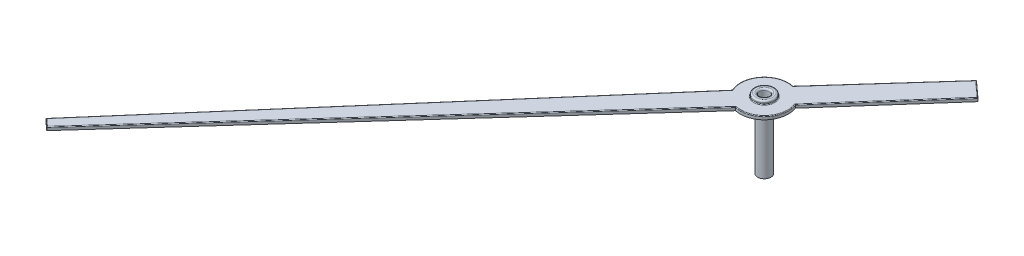
ISO-10303-21;
HEADER;
FILE_DESCRIPTION(('STEP AP214'),'2;1');
FILE_NAME('part.step','',(''),(''),'','','');
FILE_SCHEMA(('AUTOMOTIVE_DESIGN { 1 0 10303 214 1 1 1 1 }'));
ENDSEC;
DATA;
#1=APPLICATION_CONTEXT('core data for automotive mechanical design processes');
#2=APPLICATION_PROTOCOL_DEFINITION('international standard','automotive_design',2000,#1);
#3=PRODUCT_CONTEXT('',#1,'mechanical');
#4=PRODUCT('Part','Part','',(#3));
#5=PRODUCT_RELATED_PRODUCT_CATEGORY('part','',(#4));
#6=PRODUCT_DEFINITION_FORMATION('','',#4);
#7=PRODUCT_DEFINITION_CONTEXT('part definition',#1,'design');
#8=PRODUCT_DEFINITION('design','',#6,#7);
#9=PRODUCT_DEFINITION_SHAPE('','',#8);
#10=(LENGTH_UNIT() NAMED_UNIT(*) SI_UNIT(.MILLI.,.METRE.));
#11=(NAMED_UNIT(*) PLANE_ANGLE_UNIT() SI_UNIT($,.RADIAN.));
#12=(NAMED_UNIT(*) SI_UNIT($,.STERADIAN.) SOLID_ANGLE_UNIT());
#13=UNCERTAINTY_MEASURE_WITH_UNIT(LENGTH_MEASURE(1.E-05),#10,'distance_accuracy_value','');
#14=(GEOMETRIC_REPRESENTATION_CONTEXT(3) GLOBAL_UNCERTAINTY_ASSIGNED_CONTEXT((#13)) GLOBAL_UNIT_ASSIGNED_CONTEXT((#10,
#11,#12)) REPRESENTATION_CONTEXT('',''));
#15=CARTESIAN_POINT('',(0.,0.,0.));
#16=DIRECTION('',(0.,0.,1.));
#17=DIRECTION('',(1.,0.,0.));
#18=AXIS2_PLACEMENT_3D('',#15,#16,#17);
#19=CARTESIAN_POINT('',(-72.4331347315,-1.9,38.1727367454838));
#20=DIRECTION('',(0.,1.,0.));
#21=DIRECTION('',(0.,0.,1.));
#22=AXIS2_PLACEMENT_3D('',#19,#20,#21);
#23=PLANE('',#22);
#24=CARTESIAN_POINT('',(-72.4331347315,-1.9,38.1727367454838));
#25=DIRECTION('',(0.,1.,0.));
#26=DIRECTION('',(0.,0.,1.));
#27=AXIS2_PLACEMENT_3D('',#24,#25,#26);
#28=CIRCLE('',#27,0.149999999999991);
#29=CARTESIAN_POINT('',(-72.4331347315,-1.9,38.3227367454838));
#30=VERTEX_POINT('',#29);
#31=EDGE_CURVE('E158',#30,#30,#28,.T.);
#32=ORIENTED_EDGE('',*,*,#31,.T.);
#33=EDGE_LOOP('',(#32));
#34=FACE_BOUND('',#33,.T.);
#35=CARTESIAN_POINT('',(-72.4331347315,-1.9,38.1727367454838));
#36=DIRECTION('',(0.,-1.,0.));
#37=DIRECTION('',(0.,0.,-1.));
#38=AXIS2_PLACEMENT_3D('',#35,#36,#37);
#39=CIRCLE('',#38,0.200000000000002);
#40=CARTESIAN_POINT('',(-72.4331347315,-1.9,37.9727367454838));
#41=VERTEX_POINT('',#40);
#42=EDGE_CURVE('E579',#41,#41,#39,.T.);
#43=ORIENTED_EDGE('',*,*,#42,.T.);
#44=EDGE_LOOP('',(#43));
#45=FACE_BOUND('',#44,.T.);
#46=ADVANCED_FACE('F43',(#34,#45),#23,.F.);
#47=CARTESIAN_POINT('',(-20.5910862957085,0.1,-18.6227753418155));
#48=DIRECTION('',(-0.741665773740884,0.,-0.670769617723802));
#49=DIRECTION('',(-0.670769617723802,0.,0.741665773740884));
#50=AXIS2_PLACEMENT_3D('',#47,#48,#49);
#51=PLANE('',#50);
#52=DIRECTION('',(0.,-1.,0.));
#53=VECTOR('',#52,1.);
#54=CARTESIAN_POINT('',(-72.5929628220083,0.1,38.8753745009477));
#55=LINE('',#54,#53);
#56=CARTESIAN_POINT('',(-72.5929628220083,0.08,38.8753745009477));
#57=VERTEX_POINT('',#56);
#58=CARTESIAN_POINT('',(-72.5929628220083,0.,38.8753745009477));
#59=VERTEX_POINT('',#58);
#60=EDGE_CURVE('E133',#57,#59,#55,.T.);
#61=ORIENTED_EDGE('',*,*,#60,.F.);
#62=DIRECTION('',(0.670769617723802,0.,-0.741665773740884));
#63=VECTOR('',#62,1.);
#64=CARTESIAN_POINT('',(-82.4062532848466,0.08,49.7258684287479));
#65=LINE('',#64,#63);
#66=CARTESIAN_POINT('',(-82.4062532848466,0.08,49.7258684287479));
#67=VERTEX_POINT('',#66);
#68=EDGE_CURVE('E52',#57,#67,#65,.F.);
#69=ORIENTED_EDGE('',*,*,#68,.T.);
#70=DIRECTION('',(0.,-1.,0.));
#71=VECTOR('',#70,1.);
#72=CARTESIAN_POINT('',(-82.4062532848466,0.1,49.7258684287479));
#73=LINE('',#72,#71);
#74=CARTESIAN_POINT('',(-82.4062532848466,0.,49.7258684287479));
#75=VERTEX_POINT('',#74);
#76=EDGE_CURVE('E156',#67,#75,#73,.T.);
#77=ORIENTED_EDGE('',*,*,#76,.T.);
#78=DIRECTION('',(0.670769617723802,0.,-0.741665773740885));
#79=VECTOR('',#78,1.);
#80=CARTESIAN_POINT('',(-20.5910862957085,0.,-18.6227753418155));
#81=LINE('',#80,#79);
#82=EDGE_CURVE('E149',#75,#59,#81,.T.);
#83=ORIENTED_EDGE('',*,*,#82,.T.);
#84=EDGE_LOOP('',(#61,#69,#77,#83));
#85=FACE_BOUND('',#84,.T.);
#86=ADVANCED_FACE('F154',(#85),#51,.F.);
#87=CARTESIAN_POINT('',(-72.4331347315,0.1,38.1727367454838));
#88=DIRECTION('',(0.,-1.,0.));
#89=DIRECTION('',(0.,0.,-1.));
#90=AXIS2_PLACEMENT_3D('',#87,#88,#89);
#91=CYLINDRICAL_SURFACE('',#90,0.720586451384451);
#92=DIRECTION('',(0.,-1.,0.));
#93=VECTOR('',#92,1.);
#94=CARTESIAN_POINT('',(-71.7602884856588,0.1,37.9148166738022));
#95=LINE('',#94,#93);
#96=CARTESIAN_POINT('',(-71.7602884856588,0.08,37.9148166738022));
#97=VERTEX_POINT('',#96);
#98=CARTESIAN_POINT('',(-71.7602884856588,0.,37.9148166738022));
#99=VERTEX_POINT('',#98);
#100=EDGE_CURVE('E142',#97,#99,#95,.T.);
#101=ORIENTED_EDGE('',*,*,#100,.F.);
#102=CARTESIAN_POINT('',(-72.4331347315,0.08,38.1727367454838));
#103=DIRECTION('',(0.,1.,0.));
#104=DIRECTION('',(0.,0.,1.));
#105=AXIS2_PLACEMENT_3D('',#102,#103,#104);
#106=CIRCLE('',#105,0.720586451384451);
#107=EDGE_CURVE('E60',#97,#57,#106,.F.);
#108=ORIENTED_EDGE('',*,*,#107,.T.);
#109=ORIENTED_EDGE('',*,*,#60,.T.);
#110=CARTESIAN_POINT('',(-72.4331347315,0.,38.1727367454838));
#111=DIRECTION('',(0.,1.,0.));
#112=DIRECTION('',(0.,0.,1.));
#113=AXIS2_PLACEMENT_3D('',#110,#111,#112);
#114=CIRCLE('',#113,0.720586451384451);
#115=EDGE_CURVE('E136',#59,#99,#114,.T.);
#116=ORIENTED_EDGE('',*,*,#115,.T.);
#117=EDGE_LOOP('',(#101,#108,#109,#116));
#118=FACE_BOUND('',#117,.T.);
#119=ADVANCED_FACE('F135',(#118),#91,.T.);
#120=CARTESIAN_POINT('',(-21.5246084224785,0.1,-18.9989702186049));
#121=DIRECTION('',(0.749722609737751,0.,0.66175222587311));
#122=DIRECTION('',(0.66175222587311,0.,-0.749722609737751));
#123=AXIS2_PLACEMENT_3D('',#120,#121,#122);
#124=PLANE('',#123);
#125=DIRECTION('',(0.,-1.,0.));
#126=VECTOR('',#125,1.);
#127=CARTESIAN_POINT('',(-69.1910545265949,0.1,35.0040402328544));
#128=LINE('',#127,#126);
#129=CARTESIAN_POINT('',(-69.1910545265949,0.08,35.0040402328544));
#130=VERTEX_POINT('',#129);
#131=CARTESIAN_POINT('',(-69.1910545265949,0.,35.0040402328544));
#132=VERTEX_POINT('',#131);
#133=EDGE_CURVE('E189',#130,#132,#128,.T.);
#134=ORIENTED_EDGE('',*,*,#133,.F.);
#135=DIRECTION('',(-0.66175222587311,0.,0.749722609737751));
#136=VECTOR('',#135,1.);
#137=CARTESIAN_POINT('',(-21.5246084224785,0.08,-18.9989702186049));
#138=LINE('',#137,#136);
#139=EDGE_CURVE('E68',#130,#97,#138,.T.);
#140=ORIENTED_EDGE('',*,*,#139,.T.);
#141=ORIENTED_EDGE('',*,*,#100,.T.);
#142=DIRECTION('',(-0.66175222587311,0.,0.749722609737751));
#143=VECTOR('',#142,1.);
#144=CARTESIAN_POINT('',(-21.5246084224785,0.,-18.9989702186049));
#145=LINE('',#144,#143);
#146=EDGE_CURVE('E152',#132,#99,#145,.T.);
#147=ORIENTED_EDGE('',*,*,#146,.F.);
#148=EDGE_LOOP('',(#134,#140,#141,#147));
#149=FACE_BOUND('',#148,.T.);
#150=ADVANCED_FACE('F348',(#149),#124,.T.);
#151=CARTESIAN_POINT('',(-48.5634749404629,0.1,53.6692380419098));
#152=DIRECTION('',(0.670955812760769,0.,-0.74149733466988));
#153=DIRECTION('',(-0.74149733466988,0.,-0.670955812760769));
#154=AXIS2_PLACEMENT_3D('',#151,#152,#153);
#155=PLANE('',#154);
#156=DIRECTION('',(0.,-1.,0.));
#157=VECTOR('',#156,1.);
#158=CARTESIAN_POINT('',(-69.6713257880086,0.1,34.5694590422275));
#159=LINE('',#158,#157);
#160=CARTESIAN_POINT('',(-69.6713257880086,0.08,34.5694590422275));
#161=VERTEX_POINT('',#160);
#162=CARTESIAN_POINT('',(-69.6713257880086,0.,34.5694590422275));
#163=VERTEX_POINT('',#162);
#164=EDGE_CURVE('E187',#161,#163,#159,.T.);
#165=ORIENTED_EDGE('',*,*,#164,.F.);
#166=DIRECTION('',(0.74149733466988,0.,0.670955812760769));
#167=VECTOR('',#166,1.);
#168=CARTESIAN_POINT('',(-48.5634749404629,0.08,53.6692380419098));
#169=LINE('',#168,#167);
#170=EDGE_CURVE('E233',#161,#130,#169,.T.);
#171=ORIENTED_EDGE('',*,*,#170,.T.);
#172=ORIENTED_EDGE('',*,*,#133,.T.);
#173=DIRECTION('',(0.74149733466988,0.,0.670955812760769));
#174=VECTOR('',#173,1.);
#175=CARTESIAN_POINT('',(-48.5634749404629,0.,53.6692380419098));
#176=LINE('',#175,#174);
#177=EDGE_CURVE('E167',#163,#132,#176,.T.);
#178=ORIENTED_EDGE('',*,*,#177,.F.);
#179=EDGE_LOOP('',(#165,#171,#172,#178));
#180=FACE_BOUND('',#179,.T.);
#181=ADVANCED_FACE('F344',(#180),#155,.T.);
#182=CARTESIAN_POINT('',(-21.3887116348689,0.1,-19.2045125334591));
#183=DIRECTION('',(-0.744077721453353,0.,-0.66809306570027));
#184=DIRECTION('',(-0.66809306570027,0.,0.744077721453353));
#185=AXIS2_PLACEMENT_3D('',#182,#183,#184);
#186=PLANE('',#185);
#187=DIRECTION('',(0.,-1.,0.));
#188=VECTOR('',#187,1.);
#189=CARTESIAN_POINT('',(-72.2753417109591,0.1,37.4696391728899));
#190=LINE('',#189,#188);
#191=CARTESIAN_POINT('',(-72.2753417109591,0.08,37.4696391728899));
#192=VERTEX_POINT('',#191);
#193=CARTESIAN_POINT('',(-72.2753417109591,0.,37.4696391728899));
#194=VERTEX_POINT('',#193);
#195=EDGE_CURVE('E185',#192,#194,#190,.T.);
#196=ORIENTED_EDGE('',*,*,#195,.F.);
#197=DIRECTION('',(0.66809306570027,0.,-0.744077721453353));
#198=VECTOR('',#197,1.);
#199=CARTESIAN_POINT('',(-21.3887116348689,0.08,-19.2045125334591));
#200=LINE('',#199,#198);
#201=EDGE_CURVE('E231',#192,#161,#200,.T.);
#202=ORIENTED_EDGE('',*,*,#201,.T.);
#203=ORIENTED_EDGE('',*,*,#164,.T.);
#204=DIRECTION('',(0.66809306570027,0.,-0.744077721453353));
#205=VECTOR('',#204,1.);
#206=CARTESIAN_POINT('',(-21.3887116348689,0.,-19.2045125334591));
#207=LINE('',#206,#205);
#208=EDGE_CURVE('E169',#194,#163,#207,.T.);
#209=ORIENTED_EDGE('',*,*,#208,.F.);
#210=EDGE_LOOP('',(#196,#202,#203,#209));
#211=FACE_BOUND('',#210,.T.);
#212=ADVANCED_FACE('F340',(#211),#186,.T.);
#213=CARTESIAN_POINT('',(-72.4331347315,0.1,38.1727367454838));
#214=DIRECTION('',(0.,-1.,0.));
#215=DIRECTION('',(0.,0.,-1.));
#216=AXIS2_PLACEMENT_3D('',#213,#214,#215);
#217=CYLINDRICAL_SURFACE('',#216,0.720586451384451);
#218=DIRECTION('',(0.,-1.,0.));
#219=VECTOR('',#218,1.);
#220=CARTESIAN_POINT('',(-73.0841907332714,0.1,38.4815585654322));
#221=LINE('',#220,#219);
#222=CARTESIAN_POINT('',(-73.0841907332714,0.08,38.4815585654322));
#223=VERTEX_POINT('',#222);
#224=CARTESIAN_POINT('',(-73.0841907332714,0.,38.4815585654322));
#225=VERTEX_POINT('',#224);
#226=EDGE_CURVE('E183',#223,#225,#221,.T.);
#227=ORIENTED_EDGE('',*,*,#226,.F.);
#228=CARTESIAN_POINT('',(-72.4331347315,0.08,38.1727367454838));
#229=DIRECTION('',(0.,1.,0.));
#230=DIRECTION('',(0.,0.,1.));
#231=AXIS2_PLACEMENT_3D('',#228,#229,#230);
#232=CIRCLE('',#231,0.720586451384451);
#233=EDGE_CURVE('E229',#223,#192,#232,.F.);
#234=ORIENTED_EDGE('',*,*,#233,.T.);
#235=ORIENTED_EDGE('',*,*,#195,.T.);
#236=CARTESIAN_POINT('',(-72.4331347315,0.,38.1727367454838));
#237=DIRECTION('',(0.,1.,0.));
#238=DIRECTION('',(0.,0.,1.));
#239=AXIS2_PLACEMENT_3D('',#236,#237,#238);
#240=CIRCLE('',#239,0.720586451384451);
#241=EDGE_CURVE('E172',#194,#225,#240,.T.);
#242=ORIENTED_EDGE('',*,*,#241,.T.);
#243=EDGE_LOOP('',(#227,#234,#235,#242));
#244=FACE_BOUND('',#243,.T.);
#245=ADVANCED_FACE('F336',(#244),#217,.T.);
#246=CARTESIAN_POINT('',(-22.6870649744685,0.1,-19.6638535265345));
#247=DIRECTION('',(-0.755660554117765,0.,-0.65496345466784));
#248=DIRECTION('',(-0.65496345466784,0.,0.755660554117765));
#249=AXIS2_PLACEMENT_3D('',#246,#247,#248);
#250=PLANE('',#249);
#251=DIRECTION('',(0.,-1.,0.));
#252=VECTOR('',#251,1.);
#253=CARTESIAN_POINT('',(-82.6438596158767,0.1,49.5109749909264));
#254=LINE('',#253,#252);
#255=CARTESIAN_POINT('',(-82.6438596158767,0.08,49.5109749909264));
#256=VERTEX_POINT('',#255);
#257=CARTESIAN_POINT('',(-82.6438596158767,0.,49.5109749909264));
#258=VERTEX_POINT('',#257);
#259=EDGE_CURVE('E181',#256,#258,#254,.T.);
#260=ORIENTED_EDGE('',*,*,#259,.F.);
#261=DIRECTION('',(0.65496345466784,0.,-0.755660554117765));
#262=VECTOR('',#261,1.);
#263=CARTESIAN_POINT('',(-22.6870649744685,0.08,-19.6638535265345));
#264=LINE('',#263,#262);
#265=EDGE_CURVE('E227',#256,#223,#264,.T.);
#266=ORIENTED_EDGE('',*,*,#265,.T.);
#267=ORIENTED_EDGE('',*,*,#226,.T.);
#268=DIRECTION('',(0.65496345466784,0.,-0.755660554117765));
#269=VECTOR('',#268,1.);
#270=CARTESIAN_POINT('',(-22.6870649744685,0.,-19.6638535265345));
#271=LINE('',#270,#269);
#272=EDGE_CURVE('E175',#258,#225,#271,.T.);
#273=ORIENTED_EDGE('',*,*,#272,.F.);
#274=EDGE_LOOP('',(#260,#266,#267,#273));
#275=FACE_BOUND('',#274,.T.);
#276=ADVANCED_FACE('F332',(#275),#250,.T.);
#277=CARTESIAN_POINT('',(-61.815166989138,0.1,68.3486437705634));
#278=DIRECTION('',(0.670769617723801,0.,-0.741665773740885));
#279=DIRECTION('',(-0.741665773740885,0.,-0.670769617723801));
#280=AXIS2_PLACEMENT_3D('',#277,#278,#279);
#281=PLANE('',#280);
#282=ORIENTED_EDGE('',*,*,#76,.F.);
#283=DIRECTION('',(0.741665773740885,0.,0.670769617723801));
#284=VECTOR('',#283,1.);
#285=CARTESIAN_POINT('',(-82.6438596158767,0.08,49.5109749909264));
#286=LINE('',#285,#284);
#287=EDGE_CURVE('E224',#67,#256,#286,.F.);
#288=ORIENTED_EDGE('',*,*,#287,.T.);
#289=ORIENTED_EDGE('',*,*,#259,.T.);
#290=DIRECTION('',(0.741665773740885,0.,0.670769617723801));
#291=VECTOR('',#290,1.);
#292=CARTESIAN_POINT('',(-61.815166989138,0.,68.3486437705634));
#293=LINE('',#292,#291);
#294=EDGE_CURVE('E178',#258,#75,#293,.T.);
#295=ORIENTED_EDGE('',*,*,#294,.T.);
#296=EDGE_LOOP('',(#282,#288,#289,#295));
#297=FACE_BOUND('',#296,.T.);
#298=ADVANCED_FACE('F326',(#297),#281,.F.);
#299=CARTESIAN_POINT('',(0.,0.1,0.));
#300=DIRECTION('',(0.,1.,0.));
#301=DIRECTION('',(0.,0.,1.));
#302=AXIS2_PLACEMENT_3D('',#299,#300,#301);
#303=PLANE('',#302);
#304=DIRECTION('',(0.65496345466784,0.,-0.755660554117765));
#305=VECTOR('',#304,1.);
#306=CARTESIAN_POINT('',(-22.6719517633861,0.1,-19.6507542574411));
#307=LINE('',#306,#305);
#308=CARTESIAN_POINT('',(-73.060436547422,0.1,38.4846883564821));
#309=VERTEX_POINT('',#308);
#310=CARTESIAN_POINT('',(-82.6159208053029,0.1,49.5092767937649));
#311=VERTEX_POINT('',#310);
#312=EDGE_CURVE('E219',#309,#311,#307,.F.);
#313=ORIENTED_EDGE('',*,*,#312,.T.);
#314=DIRECTION('',(0.741665773740885,0.,0.670769617723801));
#315=VECTOR('',#314,1.);
#316=CARTESIAN_POINT('',(-82.3928378924922,0.1,49.7110351132731));
#317=LINE('',#316,#315);
#318=CARTESIAN_POINT('',(-82.407671207967,0.1,49.6976197209187));
#319=VERTEX_POINT('',#318);
#320=EDGE_CURVE('E221',#311,#319,#317,.T.);
#321=ORIENTED_EDGE('',*,*,#320,.T.);
#322=DIRECTION('',(0.670769617723802,0.,-0.741665773740884));
#323=VECTOR('',#322,1.);
#324=CARTESIAN_POINT('',(-72.6077961374832,0.1,38.8619591085932));
#325=LINE('',#324,#323);
#326=CARTESIAN_POINT('',(-72.599868356992,0.1,38.853193411256));
#327=VERTEX_POINT('',#326);
#328=EDGE_CURVE('E206',#319,#327,#325,.T.);
#329=ORIENTED_EDGE('',*,*,#328,.T.);
#330=CARTESIAN_POINT('',(-72.4331347315,0.1,38.1727367454838));
#331=DIRECTION('',(0.,1.,0.));
#332=DIRECTION('',(0.,0.,1.));
#333=AXIS2_PLACEMENT_3D('',#330,#331,#332);
#334=CIRCLE('',#333,0.700586451384451);
#335=CARTESIAN_POINT('',(-71.7833769516029,0.1,37.9107516250538));
#336=VERTEX_POINT('',#335);
#337=EDGE_CURVE('E208',#327,#336,#334,.T.);
#338=ORIENTED_EDGE('',*,*,#337,.T.);
#339=DIRECTION('',(-0.66175222587311,0.,0.749722609737751));
#340=VECTOR('',#339,1.);
#341=CARTESIAN_POINT('',(-21.5396028746733,0.1,-19.0122052631223));
#342=LINE('',#341,#340);
#343=CARTESIAN_POINT('',(-69.219121655976,0.1,35.0056156888131));
#344=VERTEX_POINT('',#343);
#345=EDGE_CURVE('E210',#336,#344,#342,.F.);
#346=ORIENTED_EDGE('',*,*,#345,.T.);
#347=DIRECTION('',(0.74149733466988,0.,0.670955812760769));
#348=VECTOR('',#347,1.);
#349=CARTESIAN_POINT('',(-48.5768940567181,0.1,53.6840679886032));
#350=LINE('',#349,#348);
#351=CARTESIAN_POINT('',(-69.6698576917259,0.1,34.5977599230985));
#352=VERTEX_POINT('',#351);
#353=EDGE_CURVE('E213',#344,#352,#350,.F.);
#354=ORIENTED_EDGE('',*,*,#353,.T.);
#355=DIRECTION('',(0.66809306570027,0.,-0.744077721453353));
#356=VECTOR('',#355,1.);
#357=CARTESIAN_POINT('',(-21.3738300804398,0.1,-19.1911506721451));
#358=LINE('',#357,#356);
#359=CARTESIAN_POINT('',(-72.2683627434138,0.1,37.4918024110539));
#360=VERTEX_POINT('',#359);
#361=EDGE_CURVE('E215',#352,#360,#358,.F.);
#362=ORIENTED_EDGE('',*,*,#361,.T.);
#363=CARTESIAN_POINT('',(-72.4331347315,0.1,38.1727367454838));
#364=DIRECTION('',(0.,1.,0.));
#365=DIRECTION('',(0.,0.,1.));
#366=AXIS2_PLACEMENT_3D('',#363,#364,#365);
#367=CIRCLE('',#366,0.700586451384451);
#368=EDGE_CURVE('E217',#360,#309,#367,.T.);
#369=ORIENTED_EDGE('',*,*,#368,.T.);
#370=EDGE_LOOP('',(#313,#321,#329,#338,#346,#354,#362,#369));
#371=FACE_BOUND('',#370,.T.);
#372=CARTESIAN_POINT('',(-72.4331347315,0.1,38.1727367454838));
#373=DIRECTION('',(0.,1.,0.));
#374=DIRECTION('',(0.,0.,1.));
#375=AXIS2_PLACEMENT_3D('',#372,#373,#374);
#376=CIRCLE('',#375,0.319999999999997);
#377=CARTESIAN_POINT('',(-72.4331347315,0.1,38.4927367454838));
#378=VERTEX_POINT('',#377);
#379=EDGE_CURVE('E203',#378,#378,#376,.F.);
#380=ORIENTED_EDGE('',*,*,#379,.T.);
#381=EDGE_LOOP('',(#380));
#382=FACE_BOUND('',#381,.T.);
#383=ADVANCED_FACE('F323',(#371,#382),#303,.T.);
#384=CARTESIAN_POINT('',(0.,0.,0.));
#385=DIRECTION('',(0.,1.,0.));
#386=DIRECTION('',(0.,0.,1.));
#387=AXIS2_PLACEMENT_3D('',#384,#385,#386);
#388=PLANE('',#387);
#389=ORIENTED_EDGE('',*,*,#82,.F.);
#390=ORIENTED_EDGE('',*,*,#294,.F.);
#391=ORIENTED_EDGE('',*,*,#272,.T.);
#392=ORIENTED_EDGE('',*,*,#241,.F.);
#393=ORIENTED_EDGE('',*,*,#208,.T.);
#394=ORIENTED_EDGE('',*,*,#177,.T.);
#395=ORIENTED_EDGE('',*,*,#146,.T.);
#396=ORIENTED_EDGE('',*,*,#115,.F.);
#397=EDGE_LOOP('',(#389,#390,#391,#392,#393,#394,#395,#396));
#398=FACE_BOUND('',#397,.T.);
#399=CARTESIAN_POINT('',(-72.4331347315,0.,38.1727367454838));
#400=DIRECTION('',(0.,1.,0.));
#401=DIRECTION('',(0.,0.,1.));
#402=AXIS2_PLACEMENT_3D('',#399,#400,#401);
#403=CIRCLE('',#402,0.200000000000002);
#404=CARTESIAN_POINT('',(-72.4331347315,0.,38.3727367454838));
#405=VERTEX_POINT('',#404);
#406=EDGE_CURVE('E242',#405,#405,#403,.F.);
#407=ORIENTED_EDGE('',*,*,#406,.F.);
#408=EDGE_LOOP('',(#407));
#409=FACE_BOUND('',#408,.T.);
#410=ADVANCED_FACE('F146',(#398,#409),#388,.F.);
#411=CARTESIAN_POINT('',(-72.4331347315,0.1,38.1727367454838));
#412=DIRECTION('',(0.,-1.,0.));
#413=DIRECTION('',(0.,0.,-1.));
#414=AXIS2_PLACEMENT_3D('',#411,#412,#413);
#415=CYLINDRICAL_SURFACE('',#414,0.150000000000004);
#416=CARTESIAN_POINT('',(-72.4331347315,0.15,38.1727367454838));
#417=DIRECTION('',(0.,1.,0.));
#418=DIRECTION('',(0.,0.,1.));
#419=AXIS2_PLACEMENT_3D('',#416,#417,#418);
#420=CIRCLE('',#419,0.150000000000004);
#421=CARTESIAN_POINT('',(-72.4331347315,0.15,38.3227367454838));
#422=VERTEX_POINT('',#421);
#423=EDGE_CURVE('E141',#422,#422,#420,.T.);
#424=ORIENTED_EDGE('',*,*,#423,.T.);
#425=EDGE_LOOP('',(#424));
#426=FACE_BOUND('',#425,.T.);
#427=ORIENTED_EDGE('',*,*,#31,.F.);
#428=EDGE_LOOP('',(#427));
#429=FACE_BOUND('',#428,.T.);
#430=ADVANCED_FACE('F321',(#426,#429),#415,.F.);
#431=CARTESIAN_POINT('',(-72.4331347315,-1.9,38.1727367454838));
#432=DIRECTION('',(0.,1.,0.));
#433=DIRECTION('',(0.,0.,1.));
#434=AXIS2_PLACEMENT_3D('',#431,#432,#433);
#435=CYLINDRICAL_SURFACE('',#434,0.299999999999997);
#436=CARTESIAN_POINT('',(-72.4331347315,0.12,38.1727367454838));
#437=DIRECTION('',(0.,1.,0.));
#438=DIRECTION('',(0.,0.,1.));
#439=AXIS2_PLACEMENT_3D('',#436,#437,#438);
#440=CIRCLE('',#439,0.299999999999997);
#441=CARTESIAN_POINT('',(-72.4331347315,0.12,38.4727367454838));
#442=VERTEX_POINT('',#441);
#443=EDGE_CURVE('E11',#442,#442,#440,.T.);
#444=ORIENTED_EDGE('',*,*,#443,.T.);
#445=EDGE_LOOP('',(#444));
#446=FACE_BOUND('',#445,.T.);
#447=CARTESIAN_POINT('',(-72.4331347315,0.15,38.1727367454838));
#448=DIRECTION('',(0.,1.,0.));
#449=DIRECTION('',(0.,0.,1.));
#450=AXIS2_PLACEMENT_3D('',#447,#448,#449);
#451=CIRCLE('',#450,0.299999999999997);
#452=CARTESIAN_POINT('',(-72.4331347315,0.15,38.4727367454838));
#453=VERTEX_POINT('',#452);
#454=EDGE_CURVE('E200',#453,#453,#451,.F.);
#455=ORIENTED_EDGE('',*,*,#454,.T.);
#456=EDGE_LOOP('',(#455));
#457=FACE_BOUND('',#456,.T.);
#458=ADVANCED_FACE('F318',(#446,#457),#435,.T.);
#459=CARTESIAN_POINT('',(-72.4331347315,0.2,38.1727367454838));
#460=DIRECTION('',(0.,1.,0.));
#461=DIRECTION('',(0.,0.,1.));
#462=AXIS2_PLACEMENT_3D('',#459,#460,#461);
#463=PLANE('',#462);
#464=CARTESIAN_POINT('',(-72.4331347315,0.2,38.1727367454838));
#465=DIRECTION('',(0.,1.,0.));
#466=DIRECTION('',(0.,0.,1.));
#467=AXIS2_PLACEMENT_3D('',#464,#465,#466);
#468=CIRCLE('',#467,0.200000000000004);
#469=CARTESIAN_POINT('',(-72.4331347315,0.2,38.3727367454838));
#470=VERTEX_POINT('',#469);
#471=EDGE_CURVE('E197',#470,#470,#468,.F.);
#472=ORIENTED_EDGE('',*,*,#471,.T.);
#473=EDGE_LOOP('',(#472));
#474=FACE_BOUND('',#473,.T.);
#475=CARTESIAN_POINT('',(-72.4331347315,0.2,38.1727367454838));
#476=DIRECTION('',(0.,1.,0.));
#477=DIRECTION('',(0.,0.,1.));
#478=AXIS2_PLACEMENT_3D('',#475,#476,#477);
#479=CIRCLE('',#478,0.249999999999997);
#480=CARTESIAN_POINT('',(-72.4331347315,0.2,38.4227367454838));
#481=VERTEX_POINT('',#480);
#482=EDGE_CURVE('E194',#481,#481,#479,.T.);
#483=ORIENTED_EDGE('',*,*,#482,.T.);
#484=EDGE_LOOP('',(#483));
#485=FACE_BOUND('',#484,.T.);
#486=ADVANCED_FACE('F316',(#474,#485),#463,.T.);
#487=CARTESIAN_POINT('',(-72.4331347315,0.15,38.1727367454838));
#488=DIRECTION('',(0.,1.,0.));
#489=DIRECTION('',(0.,0.,1.));
#490=AXIS2_PLACEMENT_3D('',#487,#488,#489);
#491=TOROIDAL_SURFACE('',#490,0.200000000000004,0.05);
#492=ORIENTED_EDGE('',*,*,#471,.F.);
#493=EDGE_LOOP('',(#492));
#494=FACE_BOUND('',#493,.T.);
#495=ORIENTED_EDGE('',*,*,#423,.F.);
#496=EDGE_LOOP('',(#495));
#497=FACE_BOUND('',#496,.T.);
#498=ADVANCED_FACE('F302',(#494,#497),#491,.T.);
#499=CARTESIAN_POINT('',(-72.4331347315,0.15,38.1727367454838));
#500=DIRECTION('',(0.,1.,0.));
#501=DIRECTION('',(0.,0.,1.));
#502=AXIS2_PLACEMENT_3D('',#499,#500,#501);
#503=TOROIDAL_SURFACE('',#502,0.249999999999997,0.05);
#504=ORIENTED_EDGE('',*,*,#454,.F.);
#505=EDGE_LOOP('',(#504));
#506=FACE_BOUND('',#505,.T.);
#507=ORIENTED_EDGE('',*,*,#482,.F.);
#508=EDGE_LOOP('',(#507));
#509=FACE_BOUND('',#508,.T.);
#510=ADVANCED_FACE('F297',(#506,#509),#503,.T.);
#511=CARTESIAN_POINT('',(-48.5768940567181,0.08,53.6840679886032));
#512=DIRECTION('',(0.74149733466988,0.,0.670955812760769));
#513=DIRECTION('',(0.670955812760769,0.,-0.74149733466988));
#514=AXIS2_PLACEMENT_3D('',#511,#512,#513);
#515=CYLINDRICAL_SURFACE('',#514,0.02);
#516=CARTESIAN_POINT('',(-69.219121655976,0.08,35.0056156888131));
#517=DIRECTION('',(0.056043489102263,0.,0.99842832858911));
#518=DIRECTION('',(-0.99842832858911,0.,0.0560434891022631));
#519=AXIS2_PLACEMENT_3D('',#516,#517,#518);
#520=ELLIPSE('',#519,0.0281113111250946,0.02);
#521=EDGE_CURVE('E286',#130,#344,#520,.T.);
#522=ORIENTED_EDGE('',*,*,#521,.F.);
#523=ORIENTED_EDGE('',*,*,#170,.F.);
#524=CARTESIAN_POINT('',(-69.6698576917259,0.08,34.5977599230985));
#525=DIRECTION('',(0.998657223446337,0.,-0.0518049231101871));
#526=DIRECTION('',(0.0518049231101869,0.,0.998657223446337));
#527=AXIS2_PLACEMENT_3D('',#524,#525,#526);
#528=ELLIPSE('',#527,0.0283389337266796,0.02);
#529=EDGE_CURVE('E47',#352,#161,#528,.F.);
#530=ORIENTED_EDGE('',*,*,#529,.F.);
#531=ORIENTED_EDGE('',*,*,#353,.F.);
#532=EDGE_LOOP('',(#522,#523,#530,#531));
#533=FACE_BOUND('',#532,.T.);
#534=ADVANCED_FACE('F294',(#533),#515,.T.);
#535=CARTESIAN_POINT('',(-21.3738300804398,0.08,-19.191150672145));
#536=DIRECTION('',(0.66809306570027,0.,-0.744077721453353));
#537=DIRECTION('',(-0.744077721453353,0.,-0.66809306570027));
#538=AXIS2_PLACEMENT_3D('',#535,#536,#537);
#539=CYLINDRICAL_SURFACE('',#538,0.02);
#540=ORIENTED_EDGE('',*,*,#529,.T.);
#541=ORIENTED_EDGE('',*,*,#201,.F.);
#542=CARTESIAN_POINT('',(-72.2753417109591,0.08,37.4696391728899));
#543=CARTESIAN_POINT('',(-72.2753421934425,0.081014845075704,37.4696377141886));
#544=CARTESIAN_POINT('',(-72.2753145035817,0.0820285295372322,37.4697243454285));
#545=CARTESIAN_POINT('',(-72.2752066791262,0.0840209121842396,37.4700619721361));
#546=CARTESIAN_POINT('',(-72.2751267730137,0.0849997432910297,37.4703122515325));
#547=CARTESIAN_POINT('',(-72.2749184463065,0.0868982410668949,37.4709652573238));
#548=CARTESIAN_POINT('',(-72.274790067958,0.087817958442345,37.4713678509691));
#549=CARTESIAN_POINT('',(-72.274490765271,0.0895787815525477,37.4723074453385));
#550=CARTESIAN_POINT('',(-72.274319806101,0.0904198221504198,37.4728445561009));
#551=CARTESIAN_POINT('',(-72.2739322056616,0.0920487994491609,37.4740638436965));
#552=CARTESIAN_POINT('',(-72.2737136512616,0.0928317009008653,37.4747521114102));
#553=CARTESIAN_POINT('',(-72.2732446843426,0.0942820911826476,37.4762312583793));
#554=CARTESIAN_POINT('',(-72.2729942614167,0.0949495421432158,37.4770221711554));
#555=CARTESIAN_POINT('',(-72.2724345364106,0.0962420101859742,37.4787929877733));
#556=CARTESIAN_POINT('',(-72.2721218136066,0.0968501821673016,37.4797840902305));
#557=CARTESIAN_POINT('',(-72.2714740875079,0.0979075511394747,37.4818412468419));
#558=CARTESIAN_POINT('',(-72.2711390683358,0.0983566333712847,37.4829073544392));
#559=CARTESIAN_POINT('',(-72.2704477969401,0.0991022293014686,37.4851120419634));
#560=CARTESIAN_POINT('',(-72.2700912456794,0.0993953196677296,37.4862516770871));
#561=CARTESIAN_POINT('',(-72.2693715156398,0.0998141709230411,37.4885575546039));
#562=CARTESIAN_POINT('',(-72.2690083480263,0.0999401912499604,37.4897237528763));
#563=CARTESIAN_POINT('',(-72.2685511479617,0.0999944224630676,37.4911954035539));
#564=CARTESIAN_POINT('',(-72.2684569047075,0.100000006903155,37.491498944201));
#565=CARTESIAN_POINT('',(-72.2683627434138,0.1,37.4918024110538));
#566=B_SPLINE_CURVE_WITH_KNOTS('',3,(#542,#543,#544,#545,#546,#547,#548,#549,#550,#551,#552,
#553,#554,#555,#556,#557,#558,#559,#560,#561,#562,#563,#564,#565),.UNSPECIFIED.,.F.,.F.,(4,2,2,
2,2,2,2,2,2,2,2,4),(0.,0.00303864477373455,0.00606408160754451,0.00908688767016652,
0.0121121745811497,0.0152947693684489,0.0184784061234875,0.0220766341557462,0.0256774525017474,
0.0293543362856196,0.0330255036368999,0.033978931860365),.UNSPECIFIED.);
#567=EDGE_CURVE('E281',#360,#192,#566,.F.);
#568=ORIENTED_EDGE('',*,*,#567,.F.);
#569=ORIENTED_EDGE('',*,*,#361,.F.);
#570=EDGE_LOOP('',(#540,#541,#568,#569));
#571=FACE_BOUND('',#570,.T.);
#572=ADVANCED_FACE('F291',(#571),#539,.T.);
#573=CARTESIAN_POINT('',(-21.5396028746733,0.08,-19.0122052631223));
#574=DIRECTION('',(-0.66175222587311,0.,0.749722609737751));
#575=DIRECTION('',(0.749722609737751,0.,0.66175222587311));
#576=AXIS2_PLACEMENT_3D('',#573,#574,#575);
#577=CYLINDRICAL_SURFACE('',#576,0.02);
#578=ORIENTED_EDGE('',*,*,#521,.T.);
#579=ORIENTED_EDGE('',*,*,#345,.F.);
#580=CARTESIAN_POINT('',(-71.7602884856588,0.08,37.9148166738022));
#581=CARTESIAN_POINT('',(-71.7602869479086,0.081008959420186,37.9148169675498));
#582=CARTESIAN_POINT('',(-71.7603762183938,0.0820167107834748,37.9148008403221));
#583=CARTESIAN_POINT('',(-71.7607238768364,0.0839971049280863,37.9147381232131));
#584=CARTESIAN_POINT('',(-71.7609814959101,0.0849698862164553,37.9146916718297));
#585=CARTESIAN_POINT('',(-71.7616532355903,0.0868564156656173,37.9145707045993));
#586=CARTESIAN_POINT('',(-71.7620672077725,0.0877702188533965,37.9144962153685));
#587=CARTESIAN_POINT('',(-71.7630327482304,0.0895198476666845,37.9143227858797));
#588=CARTESIAN_POINT('',(-71.7635844370111,0.0903556041149249,37.9142238242084));
#589=CARTESIAN_POINT('',(-71.7648374786181,0.0919766944374053,37.9139995362694));
#590=CARTESIAN_POINT('',(-71.7655453350796,0.0927568205966522,37.913873069578));
#591=CARTESIAN_POINT('',(-71.7670658919456,0.09420293275025,37.913602117461));
#592=CARTESIAN_POINT('',(-71.7678786250887,0.0948688829514178,37.9134576264095));
#593=CARTESIAN_POINT('',(-71.7697037331397,0.0961644357843732,37.9131340967981));
#594=CARTESIAN_POINT('',(-71.7707281966359,0.0967764831050134,37.9129530389604));
#595=CARTESIAN_POINT('',(-71.77285444391,0.0978426658042566,37.9125786191801));
#596=CARTESIAN_POINT('',(-71.7739562893525,0.0982966734873132,37.9123852474365));
#597=CARTESIAN_POINT('',(-71.7762720689948,0.0990661053634734,37.9119803908526));
#598=CARTESIAN_POINT('',(-71.77748884267,0.0993727131065292,37.9117684919115));
#599=CARTESIAN_POINT('',(-71.7799513406614,0.0998097168085322,37.9113414564683));
#600=CARTESIAN_POINT('',(-71.7811970170624,0.0999403857939586,37.9111263255078));
#601=CARTESIAN_POINT('',(-71.7827553902563,0.0999946065505159,37.9108583400972));
#602=CARTESIAN_POINT('',(-71.7830662123134,0.100000005676041,37.9108049465812));
#603=CARTESIAN_POINT('',(-71.7833769516029,0.1,37.9107516250538));
#604=B_SPLINE_CURVE_WITH_KNOTS('',3,(#580,#581,#582,#583,#584,#585,#586,#587,#588,#589,#590,
#591,#592,#593,#594,#595,#596,#597,#598,#599,#600,#601,#602,#603),.UNSPECIFIED.,.F.,.F.,(4,2,2,
2,2,2,2,2,2,2,2,4),(0.,0.00302090885956709,0.00602811612122193,0.00903247581980312,
0.0120394736683145,0.0152098696708641,0.0183812577552109,0.0219882332011609,0.0255981163440464,
0.0294031073850958,0.0332021869073432,0.034148239985193),.UNSPECIFIED.);
#605=EDGE_CURVE('E287',#97,#336,#604,.T.);
#606=ORIENTED_EDGE('',*,*,#605,.F.);
#607=ORIENTED_EDGE('',*,*,#139,.F.);
#608=EDGE_LOOP('',(#578,#579,#606,#607));
#609=FACE_BOUND('',#608,.T.);
#610=ADVANCED_FACE('F275',(#609),#577,.T.);
#611=CARTESIAN_POINT('',(-72.4331347315,0.08,38.1727367454838));
#612=DIRECTION('',(0.,1.,0.));
#613=DIRECTION('',(0.,0.,1.));
#614=AXIS2_PLACEMENT_3D('',#611,#612,#613);
#615=TOROIDAL_SURFACE('',#614,0.700586451384451,0.02);
#616=ORIENTED_EDGE('',*,*,#567,.T.);
#617=ORIENTED_EDGE('',*,*,#233,.F.);
#618=CARTESIAN_POINT('',(-73.0841907332714,0.08,38.4815585654322));
#619=CARTESIAN_POINT('',(-73.0841923510749,0.0809948444006868,38.4815583280767));
#620=CARTESIAN_POINT('',(-73.0841030095794,0.0819883656805205,38.481570535433));
#621=CARTESIAN_POINT('',(-73.0837556662867,0.0839400021605526,38.4816179034761));
#622=CARTESIAN_POINT('',(-73.0834985083574,0.0848982693025444,38.4816529493178));
#623=CARTESIAN_POINT('',(-73.0828289366399,0.0867560641615002,38.4817440408107));
#624=CARTESIAN_POINT('',(-73.0824166995854,0.0876556573810841,38.4818000625566));
#625=CARTESIAN_POINT('',(-73.0814565842482,0.0893783469685809,38.4819302248712));
#626=CARTESIAN_POINT('',(-73.0809085685407,0.0902013646645417,38.4820043837959));
#627=CARTESIAN_POINT('',(-73.0796622917939,0.0918030794877578,38.4821725418257));
#628=CARTESIAN_POINT('',(-73.0789570095478,0.0925761893972059,38.4822674616942));
#629=CARTESIAN_POINT('',(-73.0774434560022,0.0940112772387622,38.4824704323996));
#630=CARTESIAN_POINT('',(-73.0766351562934,0.0946732243981073,38.4825784868584));
#631=CARTESIAN_POINT('',(-73.0748067245948,0.0959752334543636,38.4828219407973));
#632=CARTESIAN_POINT('',(-73.0737731607622,0.0965961017328794,38.4829589854891));
#633=CARTESIAN_POINT('',(-73.0716281065305,0.097682504818071,38.4832419759392));
#634=CARTESIAN_POINT('',(-73.0705165392589,0.0981478837128474,38.4833879304592));
#635=CARTESIAN_POINT('',(-73.0680874380743,0.0989759924203299,38.4837051774934));
#636=CARTESIAN_POINT('',(-73.0667623836684,0.0993163185385092,38.4838772266289));
#637=CARTESIAN_POINT('',(-73.064078873128,0.0997985305762382,38.4842234433532));
#638=CARTESIAN_POINT('',(-73.0627204713408,0.0999407200546383,38.4843976072879));
#639=CARTESIAN_POINT('',(-73.0610523091847,0.099995000674897,38.4846100960818));
#640=CARTESIAN_POINT('',(-73.0607443867138,0.100000002774247,38.4846492609634));
#641=CARTESIAN_POINT('',(-73.0604365474219,0.1,38.4846883564821));
#642=B_SPLINE_CURVE_WITH_KNOTS('',3,(#618,#619,#620,#621,#622,#623,#624,#625,#626,#627,#628,
#629,#630,#631,#632,#633,#634,#635,#636,#637,#638,#639,#640,#641),.UNSPECIFIED.,.F.,.F.,(4,2,2,
2,2,2,2,2,2,2,2,4),(0.,0.00297837081469422,0.00594187906416207,0.00890202017762119,
0.0118651696463203,0.0150053847248865,0.0181464676694257,0.0217730074539242,0.0254031727952109,
0.0295244360715437,0.0336393783232672,0.0345705250100917),.UNSPECIFIED.);
#643=EDGE_CURVE('E252',#309,#223,#642,.F.);
#644=ORIENTED_EDGE('',*,*,#643,.F.);
#645=ORIENTED_EDGE('',*,*,#368,.F.);
#646=EDGE_LOOP('',(#616,#617,#644,#645));
#647=FACE_BOUND('',#646,.T.);
#648=ADVANCED_FACE('F271',(#647),#615,.T.);
#649=CARTESIAN_POINT('',(-72.4331347315,0.08,38.1727367454838));
#650=DIRECTION('',(0.,1.,0.));
#651=DIRECTION('',(0.,0.,1.));
#652=AXIS2_PLACEMENT_3D('',#649,#650,#651);
#653=TOROIDAL_SURFACE('',#652,0.700586451384451,0.02);
#654=ORIENTED_EDGE('',*,*,#605,.T.);
#655=ORIENTED_EDGE('',*,*,#337,.F.);
#656=CARTESIAN_POINT('',(-72.5929628220083,0.08,38.8753745009477));
#657=CARTESIAN_POINT('',(-72.5929623444826,0.0810149857066179,38.875375960546));
#658=CARTESIAN_POINT('',(-72.5929897544044,0.0820288119293532,38.8752892344327));
#659=CARTESIAN_POINT('',(-72.5930964896666,0.0840214810119315,38.874951232667));
#660=CARTESIAN_POINT('',(-72.5931755890661,0.0850004566596497,38.8747006731475));
#661=CARTESIAN_POINT('',(-72.5933818139278,0.086899240318427,38.8740469278374));
#662=CARTESIAN_POINT('',(-72.5935088976576,0.0878190989328986,38.8736438746713));
#663=CARTESIAN_POINT('',(-72.59380518317,0.0895801892494388,38.8727031956576));
#664=CARTESIAN_POINT('',(-72.5939744193763,0.0904213559118084,38.8721654598199));
#665=CARTESIAN_POINT('',(-72.5943581032693,0.0920505202810779,38.8709447721084));
#666=CARTESIAN_POINT('',(-72.5945744427124,0.0928334869644009,38.8702557282968));
#667=CARTESIAN_POINT('',(-72.5950386540735,0.0942839771718081,38.8687749020769));
#668=CARTESIAN_POINT('',(-72.5952865363027,0.0949514627769374,38.8679830860716));
#669=CARTESIAN_POINT('',(-72.5958405327186,0.0962438542948297,38.8662103796546));
#670=CARTESIAN_POINT('',(-72.5961500275025,0.096851932276293,38.8652182922005));
#671=CARTESIAN_POINT('',(-72.5967910540544,0.097909087943449,38.863159096444));
#672=CARTESIAN_POINT('',(-72.5971226014808,0.09835805118778,38.8620919348037));
#673=CARTESIAN_POINT('',(-72.5978064282052,0.0991030820146831,38.8598859312898));
#674=CARTESIAN_POINT('',(-72.598158992053,0.0993958532495562,38.8587460728249));
#675=CARTESIAN_POINT('',(-72.5988706525362,0.0998142757510468,38.8564397665792));
#676=CARTESIAN_POINT('',(-72.5992297381632,0.0999401861265302,38.855273362891));
#677=CARTESIAN_POINT('',(-72.5996818852979,0.0999944179009835,38.8538011447848));
#678=CARTESIAN_POINT('',(-72.5997751620028,0.100000006932647,38.8534972409771));
#679=CARTESIAN_POINT('',(-72.5998683569921,0.1,38.853193411256));
#680=B_SPLINE_CURVE_WITH_KNOTS('',3,(#656,#657,#658,#659,#660,#661,#662,#663,#664,#665,#666,
#667,#668,#669,#670,#671,#672,#673,#674,#675,#676,#677,#678,#679),.UNSPECIFIED.,.F.,.F.,(4,2,2,
2,2,2,2,2,2,2,2,4),(0.,0.00303906854305648,0.00606494101601621,0.00908818790109681,
0.0121139118535367,0.0152967953358434,0.0184807219630093,0.0220787367539744,0.0256793341469624,
0.029353182560225,0.0330213193495252,0.0339749331794051),.UNSPECIFIED.);
#681=EDGE_CURVE('E244',#57,#327,#680,.T.);
#682=ORIENTED_EDGE('',*,*,#681,.F.);
#683=ORIENTED_EDGE('',*,*,#107,.F.);
#684=EDGE_LOOP('',(#654,#655,#682,#683));
#685=FACE_BOUND('',#684,.T.);
#686=ADVANCED_FACE('F259',(#685),#653,.T.);
#687=CARTESIAN_POINT('',(-22.6719517633861,0.08,-19.6507542574411));
#688=DIRECTION('',(0.65496345466784,0.,-0.755660554117765));
#689=DIRECTION('',(-0.755660554117765,0.,-0.65496345466784));
#690=AXIS2_PLACEMENT_3D('',#687,#688,#689);
#691=CYLINDRICAL_SURFACE('',#690,0.02);
#692=ORIENTED_EDGE('',*,*,#643,.T.);
#693=ORIENTED_EDGE('',*,*,#265,.F.);
#694=CARTESIAN_POINT('',(-82.6159208053028,0.08,49.5092767937649));
#695=DIRECTION('',(-0.0606707574010909,0.,-0.998157832808208));
#696=DIRECTION('',(0.998157832808208,0.,-0.060670757401091));
#697=AXIS2_PLACEMENT_3D('',#694,#695,#696);
#698=ELLIPSE('',#697,0.027990373521602,0.02);
#699=EDGE_CURVE('E241',#311,#256,#698,.F.);
#700=ORIENTED_EDGE('',*,*,#699,.F.);
#701=ORIENTED_EDGE('',*,*,#312,.F.);
#702=EDGE_LOOP('',(#692,#693,#700,#701));
#703=FACE_BOUND('',#702,.T.);
#704=ADVANCED_FACE('F266',(#703),#691,.T.);
#705=CARTESIAN_POINT('',(-20.6059196111833,0.08,-18.6361907341699));
#706=DIRECTION('',(-0.670769617723802,0.,0.741665773740884));
#707=DIRECTION('',(0.741665773740884,0.,0.670769617723802));
#708=AXIS2_PLACEMENT_3D('',#705,#706,#707);
#709=CYLINDRICAL_SURFACE('',#708,0.02);
#710=ORIENTED_EDGE('',*,*,#681,.T.);
#711=ORIENTED_EDGE('',*,*,#328,.F.);
#712=CARTESIAN_POINT('',(-82.407671207967,0.08,49.6976197209187));
#713=DIRECTION('',(-0.998742643292555,0.,0.0501311526797391));
#714=DIRECTION('',(0.0501311526797392,0.,0.998742643292555));
#715=AXIS2_PLACEMENT_3D('',#712,#713,#714);
#716=ELLIPSE('',#715,0.0282842712474619,0.02);
#717=EDGE_CURVE('E239',#67,#319,#716,.T.);
#718=ORIENTED_EDGE('',*,*,#717,.F.);
#719=ORIENTED_EDGE('',*,*,#68,.F.);
#720=EDGE_LOOP('',(#710,#711,#718,#719));
#721=FACE_BOUND('',#720,.T.);
#722=ADVANCED_FACE('F262',(#721),#709,.T.);
#723=CARTESIAN_POINT('',(-61.8017515967836,0.08,68.3338104550886));
#724=DIRECTION('',(-0.741665773740885,0.,-0.670769617723801));
#725=DIRECTION('',(-0.670769617723801,0.,0.741665773740885));
#726=AXIS2_PLACEMENT_3D('',#723,#724,#725);
#727=CYLINDRICAL_SURFACE('',#726,0.02);
#728=ORIENTED_EDGE('',*,*,#699,.T.);
#729=ORIENTED_EDGE('',*,*,#287,.F.);
#730=ORIENTED_EDGE('',*,*,#717,.T.);
#731=ORIENTED_EDGE('',*,*,#320,.F.);
#732=EDGE_LOOP('',(#728,#729,#730,#731));
#733=FACE_BOUND('',#732,.T.);
#734=ADVANCED_FACE('F265',(#733),#727,.T.);
#735=CARTESIAN_POINT('',(-72.4331347315,0.12,38.1727367454838));
#736=DIRECTION('',(0.,1.,0.));
#737=DIRECTION('',(0.,0.,1.));
#738=AXIS2_PLACEMENT_3D('',#735,#736,#737);
#739=TOROIDAL_SURFACE('',#738,0.319999999999997,0.02);
#740=ORIENTED_EDGE('',*,*,#379,.F.);
#741=EDGE_LOOP('',(#740));
#742=FACE_BOUND('',#741,.T.);
#743=ORIENTED_EDGE('',*,*,#443,.F.);
#744=EDGE_LOOP('',(#743));
#745=FACE_BOUND('',#744,.T.);
#746=ADVANCED_FACE('F45',(#742,#745),#739,.F.);
#747=CARTESIAN_POINT('',(-72.4331347315,1.22020481827046,38.1727367454838));
#748=DIRECTION('',(0.,-1.,0.));
#749=DIRECTION('',(0.,0.,-1.));
#750=AXIS2_PLACEMENT_3D('',#747,#748,#749);
#751=CYLINDRICAL_SURFACE('',#750,0.200000000000002);
#752=ORIENTED_EDGE('',*,*,#42,.F.);
#753=EDGE_LOOP('',(#752));
#754=FACE_BOUND('',#753,.T.);
#755=ORIENTED_EDGE('',*,*,#406,.T.);
#756=EDGE_LOOP('',(#755));
#757=FACE_BOUND('',#756,.T.);
#758=ADVANCED_FACE('F364',(#754,#757),#751,.T.);
#759=CLOSED_SHELL('',(#46,#86,#119,#150,#181,#212,#245,#276,#298,#383,#410,#430,#458,#486,#498,
#510,#534,#572,#610,#648,#686,#704,#722,#734,#746,#758));
#760=MANIFOLD_SOLID_BREP('B2',#759);
#761=ADVANCED_BREP_SHAPE_REPRESENTATION('',(#18,#760),#14);
#762=SHAPE_DEFINITION_REPRESENTATION(#9,#761);
ENDSEC;
END-ISO-10303-21;
